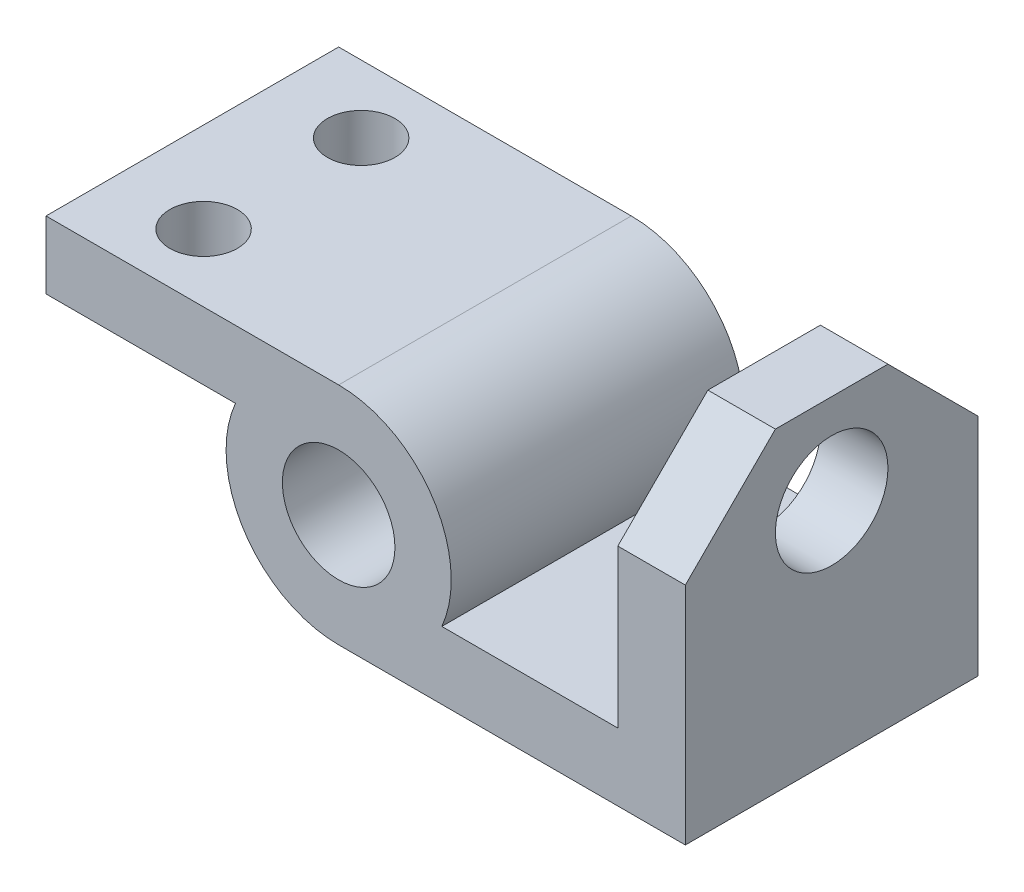
ISO-10303-21;
HEADER;
FILE_DESCRIPTION(('STEP AP214'),'2;1');
FILE_NAME('part.step','',(''),(''),'','','');
FILE_SCHEMA(('AUTOMOTIVE_DESIGN { 1 0 10303 214 1 1 1 1 }'));
ENDSEC;
DATA;
#1=APPLICATION_CONTEXT('core data for automotive mechanical design processes');
#2=APPLICATION_PROTOCOL_DEFINITION('international standard','automotive_design',2000,#1);
#3=PRODUCT_CONTEXT('',#1,'mechanical');
#4=PRODUCT('Part','Part','',(#3));
#5=PRODUCT_RELATED_PRODUCT_CATEGORY('part','',(#4));
#6=PRODUCT_DEFINITION_FORMATION('','',#4);
#7=PRODUCT_DEFINITION_CONTEXT('part definition',#1,'design');
#8=PRODUCT_DEFINITION('design','',#6,#7);
#9=PRODUCT_DEFINITION_SHAPE('','',#8);
#10=(LENGTH_UNIT() NAMED_UNIT(*) SI_UNIT(.MILLI.,.METRE.));
#11=(NAMED_UNIT(*) PLANE_ANGLE_UNIT() SI_UNIT($,.RADIAN.));
#12=(NAMED_UNIT(*) SI_UNIT($,.STERADIAN.) SOLID_ANGLE_UNIT());
#13=UNCERTAINTY_MEASURE_WITH_UNIT(LENGTH_MEASURE(1.E-05),#10,'distance_accuracy_value','');
#14=(GEOMETRIC_REPRESENTATION_CONTEXT(3) GLOBAL_UNCERTAINTY_ASSIGNED_CONTEXT((#13)) GLOBAL_UNIT_ASSIGNED_CONTEXT((#10,
#11,#12)) REPRESENTATION_CONTEXT('',''));
#15=CARTESIAN_POINT('',(0.,0.,0.));
#16=DIRECTION('',(0.,0.,1.));
#17=DIRECTION('',(1.,0.,0.));
#18=AXIS2_PLACEMENT_3D('',#15,#16,#17);
#19=CARTESIAN_POINT('',(0.,0.,-82.55));
#20=DIRECTION('',(0.,0.,1.));
#21=DIRECTION('',(1.,0.,0.));
#22=AXIS2_PLACEMENT_3D('',#19,#20,#21);
#23=CYLINDRICAL_SURFACE('',#22,31.75);
#24=DIRECTION('',(0.,0.,1.));
#25=VECTOR('',#24,1.);
#26=CARTESIAN_POINT('',(-29.0993556629696,12.7,-82.55));
#27=LINE('',#26,#25);
#28=CARTESIAN_POINT('',(-29.0993556629696,12.7,-82.55));
#29=VERTEX_POINT('',#28);
#30=CARTESIAN_POINT('',(-29.0993556629696,12.7,0.));
#31=VERTEX_POINT('',#30);
#32=EDGE_CURVE('E51',#29,#31,#27,.T.);
#33=ORIENTED_EDGE('',*,*,#32,.F.);
#34=CARTESIAN_POINT('',(0.,0.,-82.55));
#35=DIRECTION('',(0.,0.,1.));
#36=DIRECTION('',(1.,0.,0.));
#37=AXIS2_PLACEMENT_3D('',#34,#35,#36);
#38=CIRCLE('',#37,31.75);
#39=CARTESIAN_POINT('',(0.,-31.75,-82.55));
#40=VERTEX_POINT('',#39);
#41=EDGE_CURVE('E133',#29,#40,#38,.T.);
#42=ORIENTED_EDGE('',*,*,#41,.T.);
#43=DIRECTION('',(0.,0.,-1.));
#44=VECTOR('',#43,1.);
#45=CARTESIAN_POINT('',(0.,-31.75,-82.55));
#46=LINE('',#45,#44);
#47=CARTESIAN_POINT('',(0.,-31.75,0.));
#48=VERTEX_POINT('',#47);
#49=EDGE_CURVE('E199',#48,#40,#46,.T.);
#50=ORIENTED_EDGE('',*,*,#49,.F.);
#51=CARTESIAN_POINT('',(0.,0.,0.));
#52=DIRECTION('',(0.,0.,1.));
#53=DIRECTION('',(1.,0.,0.));
#54=AXIS2_PLACEMENT_3D('',#51,#52,#53);
#55=CIRCLE('',#54,31.75);
#56=EDGE_CURVE('E56',#31,#48,#55,.T.);
#57=ORIENTED_EDGE('',*,*,#56,.F.);
#58=EDGE_LOOP('',(#33,#42,#50,#57));
#59=FACE_BOUND('',#58,.T.);
#60=ADVANCED_FACE('F35',(#59),#23,.T.);
#61=DIRECTION('',(0.,0.,1.));
#62=VECTOR('',#61,1.);
#63=CARTESIAN_POINT('',(0.,31.75,-82.55));
#64=LINE('',#63,#62);
#65=CARTESIAN_POINT('',(0.,31.75,-82.55));
#66=VERTEX_POINT('',#65);
#67=CARTESIAN_POINT('',(0.,31.75,0.));
#68=VERTEX_POINT('',#67);
#69=EDGE_CURVE('E126',#66,#68,#64,.T.);
#70=ORIENTED_EDGE('',*,*,#69,.T.);
#71=CARTESIAN_POINT('',(29.0993556629696,-12.7,0.));
#72=VERTEX_POINT('',#71);
#73=EDGE_CURVE('E213',#72,#68,#55,.T.);
#74=ORIENTED_EDGE('',*,*,#73,.F.);
#75=DIRECTION('',(0.,0.,1.));
#76=VECTOR('',#75,1.);
#77=CARTESIAN_POINT('',(29.0993556629696,-12.7,-82.55));
#78=LINE('',#77,#76);
#79=CARTESIAN_POINT('',(29.0993556629696,-12.7,-82.55));
#80=VERTEX_POINT('',#79);
#81=EDGE_CURVE('E129',#80,#72,#78,.T.);
#82=ORIENTED_EDGE('',*,*,#81,.F.);
#83=EDGE_CURVE('E122',#80,#66,#38,.T.);
#84=ORIENTED_EDGE('',*,*,#83,.T.);
#85=EDGE_LOOP('',(#70,#74,#82,#84));
#86=FACE_BOUND('',#85,.T.);
#87=ADVANCED_FACE('F124',(#86),#23,.T.);
#88=CARTESIAN_POINT('',(0.,0.,-82.55));
#89=DIRECTION('',(0.,0.,1.));
#90=DIRECTION('',(1.,0.,0.));
#91=AXIS2_PLACEMENT_3D('',#88,#89,#90);
#92=PLANE('',#91);
#93=CARTESIAN_POINT('',(0.,0.,-82.55));
#94=DIRECTION('',(0.,0.,1.));
#95=DIRECTION('',(1.,0.,0.));
#96=AXIS2_PLACEMENT_3D('',#93,#94,#95);
#97=CIRCLE('',#96,15.875);
#98=CARTESIAN_POINT('',(15.875,0.,-82.55));
#99=VERTEX_POINT('',#98);
#100=EDGE_CURVE('E148',#99,#99,#97,.T.);
#101=ORIENTED_EDGE('',*,*,#100,.T.);
#102=EDGE_LOOP('',(#101));
#103=FACE_BOUND('',#102,.T.);
#104=ORIENTED_EDGE('',*,*,#41,.F.);
#105=DIRECTION('',(1.,0.,0.));
#106=VECTOR('',#105,1.);
#107=CARTESIAN_POINT('',(-82.55,12.7,-82.55));
#108=LINE('',#107,#106);
#109=CARTESIAN_POINT('',(-82.55,12.7,-82.55));
#110=VERTEX_POINT('',#109);
#111=EDGE_CURVE('E163',#110,#29,#108,.T.);
#112=ORIENTED_EDGE('',*,*,#111,.F.);
#113=DIRECTION('',(0.,1.,0.));
#114=VECTOR('',#113,1.);
#115=CARTESIAN_POINT('',(-82.55,12.7,-82.55));
#116=LINE('',#115,#114);
#117=CARTESIAN_POINT('',(-82.55,31.75,-82.55));
#118=VERTEX_POINT('',#117);
#119=EDGE_CURVE('E139',#110,#118,#116,.T.);
#120=ORIENTED_EDGE('',*,*,#119,.T.);
#121=DIRECTION('',(1.,0.,0.));
#122=VECTOR('',#121,1.);
#123=CARTESIAN_POINT('',(-82.55,31.75,-82.55));
#124=LINE('',#123,#122);
#125=EDGE_CURVE('E136',#118,#66,#124,.T.);
#126=ORIENTED_EDGE('',*,*,#125,.T.);
#127=ORIENTED_EDGE('',*,*,#83,.F.);
#128=DIRECTION('',(1.,0.,0.));
#129=VECTOR('',#128,1.);
#130=CARTESIAN_POINT('',(0.,-12.7,-82.55));
#131=LINE('',#130,#129);
#132=CARTESIAN_POINT('',(78.74,-12.7,-82.55));
#133=VERTEX_POINT('',#132);
#134=EDGE_CURVE('E209',#80,#133,#131,.T.);
#135=ORIENTED_EDGE('',*,*,#134,.T.);
#136=DIRECTION('',(0.,1.,0.));
#137=VECTOR('',#136,1.);
#138=CARTESIAN_POINT('',(78.74,-31.75,-82.55));
#139=LINE('',#138,#137);
#140=CARTESIAN_POINT('',(78.74,31.75,-82.55));
#141=VERTEX_POINT('',#140);
#142=EDGE_CURVE('E175',#133,#141,#139,.T.);
#143=ORIENTED_EDGE('',*,*,#142,.T.);
#144=DIRECTION('',(1.,0.,0.));
#145=VECTOR('',#144,1.);
#146=CARTESIAN_POINT('',(0.,31.75,-82.55));
#147=LINE('',#146,#145);
#148=CARTESIAN_POINT('',(97.79,31.75,-82.55));
#149=VERTEX_POINT('',#148);
#150=EDGE_CURVE('E223',#141,#149,#147,.T.);
#151=ORIENTED_EDGE('',*,*,#150,.T.);
#152=DIRECTION('',(0.,1.,0.));
#153=VECTOR('',#152,1.);
#154=CARTESIAN_POINT('',(97.79,-31.75,-82.55));
#155=LINE('',#154,#153);
#156=CARTESIAN_POINT('',(97.79,-31.75,-82.55));
#157=VERTEX_POINT('',#156);
#158=EDGE_CURVE('E181',#157,#149,#155,.T.);
#159=ORIENTED_EDGE('',*,*,#158,.F.);
#160=DIRECTION('',(1.,0.,0.));
#161=VECTOR('',#160,1.);
#162=CARTESIAN_POINT('',(0.,-31.75,-82.55));
#163=LINE('',#162,#161);
#164=EDGE_CURVE('E202',#40,#157,#163,.T.);
#165=ORIENTED_EDGE('',*,*,#164,.F.);
#166=EDGE_LOOP('',(#104,#112,#120,#126,#127,#135,#143,#151,#159,#165));
#167=FACE_BOUND('',#166,.T.);
#168=ADVANCED_FACE('F137',(#103,#167),#92,.F.);
#169=CARTESIAN_POINT('',(0.,0.,0.));
#170=DIRECTION('',(0.,0.,1.));
#171=DIRECTION('',(1.,0.,0.));
#172=AXIS2_PLACEMENT_3D('',#169,#170,#171);
#173=PLANE('',#172);
#174=CARTESIAN_POINT('',(0.,0.,0.));
#175=DIRECTION('',(0.,0.,1.));
#176=DIRECTION('',(1.,0.,0.));
#177=AXIS2_PLACEMENT_3D('',#174,#175,#176);
#178=CIRCLE('',#177,15.875);
#179=CARTESIAN_POINT('',(15.875,0.,0.));
#180=VERTEX_POINT('',#179);
#181=EDGE_CURVE('E153',#180,#180,#178,.T.);
#182=ORIENTED_EDGE('',*,*,#181,.F.);
#183=EDGE_LOOP('',(#182));
#184=FACE_BOUND('',#183,.T.);
#185=ORIENTED_EDGE('',*,*,#73,.T.);
#186=DIRECTION('',(1.,0.,0.));
#187=VECTOR('',#186,1.);
#188=CARTESIAN_POINT('',(-82.55,31.75,0.));
#189=LINE('',#188,#187);
#190=CARTESIAN_POINT('',(-82.55,31.75,0.));
#191=VERTEX_POINT('',#190);
#192=EDGE_CURVE('E143',#191,#68,#189,.T.);
#193=ORIENTED_EDGE('',*,*,#192,.F.);
#194=DIRECTION('',(0.,-1.,0.));
#195=VECTOR('',#194,1.);
#196=CARTESIAN_POINT('',(-82.55,31.75,0.));
#197=LINE('',#196,#195);
#198=CARTESIAN_POINT('',(-82.55,12.7,0.));
#199=VERTEX_POINT('',#198);
#200=EDGE_CURVE('E158',#191,#199,#197,.T.);
#201=ORIENTED_EDGE('',*,*,#200,.T.);
#202=DIRECTION('',(1.,0.,0.));
#203=VECTOR('',#202,1.);
#204=CARTESIAN_POINT('',(-82.55,12.7,0.));
#205=LINE('',#204,#203);
#206=EDGE_CURVE('E166',#199,#31,#205,.T.);
#207=ORIENTED_EDGE('',*,*,#206,.T.);
#208=ORIENTED_EDGE('',*,*,#56,.T.);
#209=DIRECTION('',(1.,0.,0.));
#210=VECTOR('',#209,1.);
#211=CARTESIAN_POINT('',(0.,-31.75,0.));
#212=LINE('',#211,#210);
#213=CARTESIAN_POINT('',(97.79,-31.75,0.));
#214=VERTEX_POINT('',#213);
#215=EDGE_CURVE('E203',#48,#214,#212,.T.);
#216=ORIENTED_EDGE('',*,*,#215,.T.);
#217=DIRECTION('',(0.,-1.,0.));
#218=VECTOR('',#217,1.);
#219=CARTESIAN_POINT('',(97.79,-31.75,0.));
#220=LINE('',#219,#218);
#221=CARTESIAN_POINT('',(97.79,31.75,0.));
#222=VERTEX_POINT('',#221);
#223=EDGE_CURVE('E188',#222,#214,#220,.T.);
#224=ORIENTED_EDGE('',*,*,#223,.F.);
#225=DIRECTION('',(-1.,0.,0.));
#226=VECTOR('',#225,1.);
#227=CARTESIAN_POINT('',(78.74,31.75,0.));
#228=LINE('',#227,#226);
#229=CARTESIAN_POINT('',(78.74,31.75,0.));
#230=VERTEX_POINT('',#229);
#231=EDGE_CURVE('E11',#222,#230,#228,.T.);
#232=ORIENTED_EDGE('',*,*,#231,.T.);
#233=DIRECTION('',(0.,-1.,0.));
#234=VECTOR('',#233,1.);
#235=CARTESIAN_POINT('',(78.74,-31.75,0.));
#236=LINE('',#235,#234);
#237=CARTESIAN_POINT('',(78.74,-12.7,0.));
#238=VERTEX_POINT('',#237);
#239=EDGE_CURVE('E182',#230,#238,#236,.T.);
#240=ORIENTED_EDGE('',*,*,#239,.T.);
#241=DIRECTION('',(1.,0.,0.));
#242=VECTOR('',#241,1.);
#243=CARTESIAN_POINT('',(0.,-12.7,0.));
#244=LINE('',#243,#242);
#245=EDGE_CURVE('E206',#72,#238,#244,.T.);
#246=ORIENTED_EDGE('',*,*,#245,.F.);
#247=EDGE_LOOP('',(#185,#193,#201,#207,#208,#216,#224,#232,#240,#246));
#248=FACE_BOUND('',#247,.T.);
#249=ADVANCED_FACE('F250',(#184,#248),#173,.T.);
#250=CARTESIAN_POINT('',(0.,-31.75,-82.55));
#251=DIRECTION('',(0.,-1.,0.));
#252=DIRECTION('',(0.,0.,-1.));
#253=AXIS2_PLACEMENT_3D('',#250,#251,#252);
#254=PLANE('',#253);
#255=ORIENTED_EDGE('',*,*,#164,.T.);
#256=DIRECTION('',(0.,0.,-1.));
#257=VECTOR('',#256,1.);
#258=CARTESIAN_POINT('',(97.79,-31.75,0.));
#259=LINE('',#258,#257);
#260=EDGE_CURVE('E178',#214,#157,#259,.T.);
#261=ORIENTED_EDGE('',*,*,#260,.F.);
#262=ORIENTED_EDGE('',*,*,#215,.F.);
#263=ORIENTED_EDGE('',*,*,#49,.T.);
#264=EDGE_LOOP('',(#255,#261,#262,#263));
#265=FACE_BOUND('',#264,.T.);
#266=ADVANCED_FACE('F257',(#265),#254,.T.);
#267=CARTESIAN_POINT('',(0.,-12.7,0.));
#268=DIRECTION('',(0.,1.,0.));
#269=DIRECTION('',(0.,0.,1.));
#270=AXIS2_PLACEMENT_3D('',#267,#268,#269);
#271=PLANE('',#270);
#272=ORIENTED_EDGE('',*,*,#134,.F.);
#273=ORIENTED_EDGE('',*,*,#81,.T.);
#274=ORIENTED_EDGE('',*,*,#245,.T.);
#275=DIRECTION('',(0.,0.,1.));
#276=VECTOR('',#275,1.);
#277=CARTESIAN_POINT('',(78.74,-12.7,0.));
#278=LINE('',#277,#276);
#279=EDGE_CURVE('E190',#133,#238,#278,.T.);
#280=ORIENTED_EDGE('',*,*,#279,.F.);
#281=EDGE_LOOP('',(#272,#273,#274,#280));
#282=FACE_BOUND('',#281,.T.);
#283=ADVANCED_FACE('F246',(#282),#271,.T.);
#284=CARTESIAN_POINT('',(78.74,0.,0.));
#285=DIRECTION('',(1.,0.,0.));
#286=DIRECTION('',(0.,0.,-1.));
#287=AXIS2_PLACEMENT_3D('',#284,#285,#286);
#288=PLANE('',#287);
#289=CARTESIAN_POINT('',(78.74,31.75,-41.275));
#290=DIRECTION('',(1.,0.,0.));
#291=DIRECTION('',(0.,0.,-1.));
#292=AXIS2_PLACEMENT_3D('',#289,#290,#291);
#293=CIRCLE('',#292,15.875);
#294=CARTESIAN_POINT('',(78.74,31.75,-57.15));
#295=VERTEX_POINT('',#294);
#296=EDGE_CURVE('E171',#295,#295,#293,.T.);
#297=ORIENTED_EDGE('',*,*,#296,.T.);
#298=EDGE_LOOP('',(#297));
#299=FACE_BOUND('',#298,.T.);
#300=DIRECTION('',(0.,0.,1.));
#301=VECTOR('',#300,1.);
#302=CARTESIAN_POINT('',(78.74,57.15,-82.55));
#303=LINE('',#302,#301);
#304=CARTESIAN_POINT('',(78.74,57.15,-57.15));
#305=VERTEX_POINT('',#304);
#306=CARTESIAN_POINT('',(78.74,57.15,-25.4000000000001));
#307=VERTEX_POINT('',#306);
#308=EDGE_CURVE('E193',#305,#307,#303,.T.);
#309=ORIENTED_EDGE('',*,*,#308,.F.);
#310=DIRECTION('',(0.,0.707106781186548,0.707106781186547));
#311=VECTOR('',#310,1.);
#312=CARTESIAN_POINT('',(78.74,57.15,-57.15));
#313=LINE('',#312,#311);
#314=EDGE_CURVE('E221',#305,#141,#313,.F.);
#315=ORIENTED_EDGE('',*,*,#314,.T.);
#316=ORIENTED_EDGE('',*,*,#142,.F.);
#317=ORIENTED_EDGE('',*,*,#279,.T.);
#318=ORIENTED_EDGE('',*,*,#239,.F.);
#319=DIRECTION('',(0.,0.707106781186547,-0.707106781186549));
#320=VECTOR('',#319,1.);
#321=CARTESIAN_POINT('',(78.74,31.75,0.));
#322=LINE('',#321,#320);
#323=EDGE_CURVE('E219',#230,#307,#322,.T.);
#324=ORIENTED_EDGE('',*,*,#323,.T.);
#325=EDGE_LOOP('',(#309,#315,#316,#317,#318,#324));
#326=FACE_BOUND('',#325,.T.);
#327=ADVANCED_FACE('F243',(#299,#326),#288,.F.);
#328=CARTESIAN_POINT('',(97.79,0.,0.));
#329=DIRECTION('',(1.,0.,0.));
#330=DIRECTION('',(0.,0.,-1.));
#331=AXIS2_PLACEMENT_3D('',#328,#329,#330);
#332=PLANE('',#331);
#333=ORIENTED_EDGE('',*,*,#158,.T.);
#334=DIRECTION('',(0.,-0.707106781186548,-0.707106781186547));
#335=VECTOR('',#334,1.);
#336=CARTESIAN_POINT('',(97.79,57.15,-57.15));
#337=LINE('',#336,#335);
#338=CARTESIAN_POINT('',(97.79,57.15,-57.15));
#339=VERTEX_POINT('',#338);
#340=EDGE_CURVE('E44',#149,#339,#337,.F.);
#341=ORIENTED_EDGE('',*,*,#340,.T.);
#342=DIRECTION('',(0.,0.,1.));
#343=VECTOR('',#342,1.);
#344=CARTESIAN_POINT('',(97.79,57.15,-82.55));
#345=LINE('',#344,#343);
#346=CARTESIAN_POINT('',(97.79,57.15,-25.4000000000001));
#347=VERTEX_POINT('',#346);
#348=EDGE_CURVE('E185',#339,#347,#345,.T.);
#349=ORIENTED_EDGE('',*,*,#348,.T.);
#350=DIRECTION('',(0.,-0.707106781186547,0.707106781186549));
#351=VECTOR('',#350,1.);
#352=CARTESIAN_POINT('',(97.79,15.875,15.875));
#353=LINE('',#352,#351);
#354=EDGE_CURVE('E225',#347,#222,#353,.T.);
#355=ORIENTED_EDGE('',*,*,#354,.T.);
#356=ORIENTED_EDGE('',*,*,#223,.T.);
#357=ORIENTED_EDGE('',*,*,#260,.T.);
#358=EDGE_LOOP('',(#333,#341,#349,#355,#356,#357));
#359=FACE_BOUND('',#358,.T.);
#360=CARTESIAN_POINT('',(97.79,31.75,-41.275));
#361=DIRECTION('',(1.,0.,0.));
#362=DIRECTION('',(0.,0.,-1.));
#363=AXIS2_PLACEMENT_3D('',#360,#361,#362);
#364=CIRCLE('',#363,15.875);
#365=CARTESIAN_POINT('',(97.79,31.75,-57.15));
#366=VERTEX_POINT('',#365);
#367=EDGE_CURVE('E172',#366,#366,#364,.T.);
#368=ORIENTED_EDGE('',*,*,#367,.F.);
#369=EDGE_LOOP('',(#368));
#370=FACE_BOUND('',#369,.T.);
#371=ADVANCED_FACE('F229',(#359,#370),#332,.T.);
#372=CARTESIAN_POINT('',(97.79,57.15,-82.55));
#373=DIRECTION('',(0.,-1.,0.));
#374=DIRECTION('',(0.,0.,-1.));
#375=AXIS2_PLACEMENT_3D('',#372,#373,#374);
#376=PLANE('',#375);
#377=ORIENTED_EDGE('',*,*,#348,.F.);
#378=DIRECTION('',(-1.,0.,0.));
#379=VECTOR('',#378,1.);
#380=CARTESIAN_POINT('',(97.79,57.15,-57.15));
#381=LINE('',#380,#379);
#382=EDGE_CURVE('E216',#339,#305,#381,.T.);
#383=ORIENTED_EDGE('',*,*,#382,.T.);
#384=ORIENTED_EDGE('',*,*,#308,.T.);
#385=DIRECTION('',(1.,0.,0.));
#386=VECTOR('',#385,1.);
#387=CARTESIAN_POINT('',(97.79,57.15,-25.4000000000001));
#388=LINE('',#387,#386);
#389=EDGE_CURVE('E132',#307,#347,#388,.T.);
#390=ORIENTED_EDGE('',*,*,#389,.T.);
#391=EDGE_LOOP('',(#377,#383,#384,#390));
#392=FACE_BOUND('',#391,.T.);
#393=ADVANCED_FACE('F237',(#392),#376,.F.);
#394=CARTESIAN_POINT('',(97.79,31.75,-41.275));
#395=DIRECTION('',(-1.,0.,0.));
#396=DIRECTION('',(0.,0.,1.));
#397=AXIS2_PLACEMENT_3D('',#394,#395,#396);
#398=CYLINDRICAL_SURFACE('',#397,15.875);
#399=ORIENTED_EDGE('',*,*,#367,.T.);
#400=EDGE_LOOP('',(#399));
#401=FACE_BOUND('',#400,.T.);
#402=ORIENTED_EDGE('',*,*,#296,.F.);
#403=EDGE_LOOP('',(#402));
#404=FACE_BOUND('',#403,.T.);
#405=ADVANCED_FACE('F289',(#401,#404),#398,.F.);
#406=CARTESIAN_POINT('',(97.79,57.15,-57.15));
#407=DIRECTION('',(0.,-0.707106781186547,0.707106781186548));
#408=DIRECTION('',(-1.,0.,0.));
#409=AXIS2_PLACEMENT_3D('',#406,#407,#408);
#410=PLANE('',#409);
#411=ORIENTED_EDGE('',*,*,#340,.F.);
#412=ORIENTED_EDGE('',*,*,#150,.F.);
#413=ORIENTED_EDGE('',*,*,#314,.F.);
#414=ORIENTED_EDGE('',*,*,#382,.F.);
#415=EDGE_LOOP('',(#411,#412,#413,#414));
#416=FACE_BOUND('',#415,.T.);
#417=ADVANCED_FACE('F240',(#416),#410,.F.);
#418=CARTESIAN_POINT('',(0.,31.75,0.));
#419=DIRECTION('',(0.,0.707106781186548,0.707106781186546));
#420=DIRECTION('',(1.,0.,0.));
#421=AXIS2_PLACEMENT_3D('',#418,#419,#420);
#422=PLANE('',#421);
#423=ORIENTED_EDGE('',*,*,#354,.F.);
#424=ORIENTED_EDGE('',*,*,#389,.F.);
#425=ORIENTED_EDGE('',*,*,#323,.F.);
#426=ORIENTED_EDGE('',*,*,#231,.F.);
#427=EDGE_LOOP('',(#423,#424,#425,#426));
#428=FACE_BOUND('',#427,.T.);
#429=ADVANCED_FACE('F38',(#428),#422,.T.);
#430=CARTESIAN_POINT('',(-82.55,12.7,0.));
#431=DIRECTION('',(0.,-1.,0.));
#432=DIRECTION('',(0.,0.,-1.));
#433=AXIS2_PLACEMENT_3D('',#430,#431,#432);
#434=PLANE('',#433);
#435=CARTESIAN_POINT('',(-57.15,12.7,-63.5));
#436=DIRECTION('',(0.,-1.,0.));
#437=DIRECTION('',(0.,0.,-1.));
#438=AXIS2_PLACEMENT_3D('',#435,#436,#437);
#439=CIRCLE('',#438,9.52500000000002);
#440=CARTESIAN_POINT('',(-57.15,12.7,-73.025));
#441=VERTEX_POINT('',#440);
#442=EDGE_CURVE('E322',#441,#441,#439,.T.);
#443=ORIENTED_EDGE('',*,*,#442,.F.);
#444=EDGE_LOOP('',(#443));
#445=FACE_BOUND('',#444,.T.);
#446=CARTESIAN_POINT('',(-57.15,12.7,-19.05));
#447=DIRECTION('',(0.,-1.,0.));
#448=DIRECTION('',(0.,0.,-1.));
#449=AXIS2_PLACEMENT_3D('',#446,#447,#448);
#450=CIRCLE('',#449,9.52500000000002);
#451=CARTESIAN_POINT('',(-57.15,12.7,-28.575));
#452=VERTEX_POINT('',#451);
#453=EDGE_CURVE('E324',#452,#452,#450,.T.);
#454=ORIENTED_EDGE('',*,*,#453,.F.);
#455=EDGE_LOOP('',(#454));
#456=FACE_BOUND('',#455,.T.);
#457=ORIENTED_EDGE('',*,*,#111,.T.);
#458=ORIENTED_EDGE('',*,*,#32,.T.);
#459=ORIENTED_EDGE('',*,*,#206,.F.);
#460=DIRECTION('',(0.,0.,-1.));
#461=VECTOR('',#460,1.);
#462=CARTESIAN_POINT('',(-82.55,12.7,0.));
#463=LINE('',#462,#461);
#464=EDGE_CURVE('E144',#199,#110,#463,.T.);
#465=ORIENTED_EDGE('',*,*,#464,.T.);
#466=EDGE_LOOP('',(#457,#458,#459,#465));
#467=FACE_BOUND('',#466,.T.);
#468=ADVANCED_FACE('F260',(#445,#456,#467),#434,.T.);
#469=CARTESIAN_POINT('',(-82.55,31.75,-82.55));
#470=DIRECTION('',(0.,1.,0.));
#471=DIRECTION('',(0.,0.,1.));
#472=AXIS2_PLACEMENT_3D('',#469,#470,#471);
#473=PLANE('',#472);
#474=CARTESIAN_POINT('',(-57.15,31.75,-63.5));
#475=DIRECTION('',(0.,1.,0.));
#476=DIRECTION('',(0.,0.,1.));
#477=AXIS2_PLACEMENT_3D('',#474,#475,#476);
#478=CIRCLE('',#477,9.52500000000002);
#479=CARTESIAN_POINT('',(-57.15,31.75,-53.975));
#480=VERTEX_POINT('',#479);
#481=EDGE_CURVE('E329',#480,#480,#478,.T.);
#482=ORIENTED_EDGE('',*,*,#481,.F.);
#483=EDGE_LOOP('',(#482));
#484=FACE_BOUND('',#483,.T.);
#485=CARTESIAN_POINT('',(-57.15,31.75,-19.05));
#486=DIRECTION('',(0.,1.,0.));
#487=DIRECTION('',(0.,0.,-1.));
#488=AXIS2_PLACEMENT_3D('',#485,#486,#487);
#489=CIRCLE('',#488,9.52500000000002);
#490=CARTESIAN_POINT('',(-57.15,31.75,-28.575));
#491=VERTEX_POINT('',#490);
#492=EDGE_CURVE('E330',#491,#491,#489,.T.);
#493=ORIENTED_EDGE('',*,*,#492,.F.);
#494=EDGE_LOOP('',(#493));
#495=FACE_BOUND('',#494,.T.);
#496=ORIENTED_EDGE('',*,*,#192,.T.);
#497=ORIENTED_EDGE('',*,*,#69,.F.);
#498=ORIENTED_EDGE('',*,*,#125,.F.);
#499=DIRECTION('',(0.,0.,1.));
#500=VECTOR('',#499,1.);
#501=CARTESIAN_POINT('',(-82.55,31.75,-82.55));
#502=LINE('',#501,#500);
#503=EDGE_CURVE('E150',#118,#191,#502,.T.);
#504=ORIENTED_EDGE('',*,*,#503,.T.);
#505=EDGE_LOOP('',(#496,#497,#498,#504));
#506=FACE_BOUND('',#505,.T.);
#507=ADVANCED_FACE('F147',(#484,#495,#506),#473,.T.);
#508=CARTESIAN_POINT('',(-82.55,0.,0.));
#509=DIRECTION('',(1.,0.,0.));
#510=DIRECTION('',(0.,0.,-1.));
#511=AXIS2_PLACEMENT_3D('',#508,#509,#510);
#512=PLANE('',#511);
#513=ORIENTED_EDGE('',*,*,#119,.F.);
#514=ORIENTED_EDGE('',*,*,#464,.F.);
#515=ORIENTED_EDGE('',*,*,#200,.F.);
#516=ORIENTED_EDGE('',*,*,#503,.F.);
#517=EDGE_LOOP('',(#513,#514,#515,#516));
#518=FACE_BOUND('',#517,.T.);
#519=ADVANCED_FACE('F264',(#518),#512,.F.);
#520=CARTESIAN_POINT('',(0.,0.,-163.576));
#521=DIRECTION('',(0.,0.,1.));
#522=DIRECTION('',(1.,0.,0.));
#523=AXIS2_PLACEMENT_3D('',#520,#521,#522);
#524=CYLINDRICAL_SURFACE('',#523,15.875);
#525=ORIENTED_EDGE('',*,*,#181,.T.);
#526=EDGE_LOOP('',(#525));
#527=FACE_BOUND('',#526,.T.);
#528=ORIENTED_EDGE('',*,*,#100,.F.);
#529=EDGE_LOOP('',(#528));
#530=FACE_BOUND('',#529,.T.);
#531=ADVANCED_FACE('F266',(#527,#530),#524,.F.);
#532=CARTESIAN_POINT('',(-57.15,-131.826,-19.05));
#533=DIRECTION('',(0.,1.,0.));
#534=DIRECTION('',(0.,0.,1.));
#535=AXIS2_PLACEMENT_3D('',#532,#533,#534);
#536=CYLINDRICAL_SURFACE('',#535,9.52500000000002);
#537=ORIENTED_EDGE('',*,*,#453,.T.);
#538=EDGE_LOOP('',(#537));
#539=FACE_BOUND('',#538,.T.);
#540=ORIENTED_EDGE('',*,*,#492,.T.);
#541=EDGE_LOOP('',(#540));
#542=FACE_BOUND('',#541,.T.);
#543=ADVANCED_FACE('F272',(#539,#542),#536,.F.);
#544=CARTESIAN_POINT('',(-57.15,-131.826,-63.5));
#545=DIRECTION('',(0.,1.,0.));
#546=DIRECTION('',(0.,0.,1.));
#547=AXIS2_PLACEMENT_3D('',#544,#545,#546);
#548=CYLINDRICAL_SURFACE('',#547,9.52500000000002);
#549=ORIENTED_EDGE('',*,*,#442,.T.);
#550=EDGE_LOOP('',(#549));
#551=FACE_BOUND('',#550,.T.);
#552=ORIENTED_EDGE('',*,*,#481,.T.);
#553=EDGE_LOOP('',(#552));
#554=FACE_BOUND('',#553,.T.);
#555=ADVANCED_FACE('F336',(#551,#554),#548,.F.);
#556=CLOSED_SHELL('',(#60,#87,#168,#249,#266,#283,#327,#371,#393,#405,#417,#429,#468,#507,#519,
#531,#543,#555));
#557=MANIFOLD_SOLID_BREP('B2',#556);
#558=ADVANCED_BREP_SHAPE_REPRESENTATION('',(#18,#557),#14);
#559=SHAPE_DEFINITION_REPRESENTATION(#9,#558);
ENDSEC;
END-ISO-10303-21;
